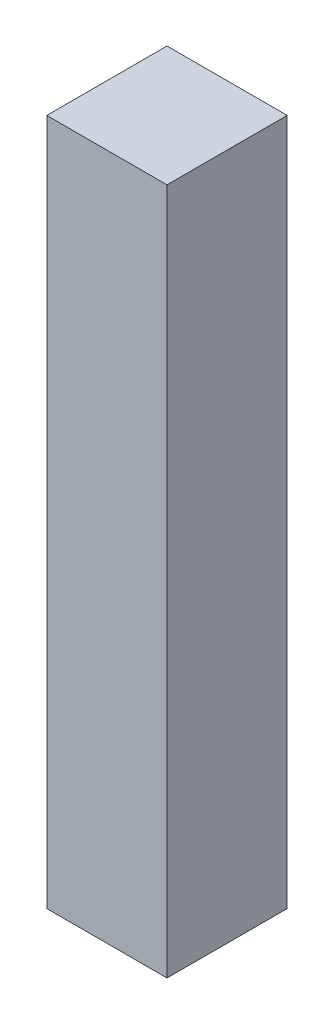
ISO-10303-21;
HEADER;
FILE_DESCRIPTION(('STEP AP214'),'2;1');
FILE_NAME('part.step','',(''),(''),'','','');
FILE_SCHEMA(('AUTOMOTIVE_DESIGN { 1 0 10303 214 1 1 1 1 }'));
ENDSEC;
DATA;
#1=APPLICATION_CONTEXT('core data for automotive mechanical design processes');
#2=APPLICATION_PROTOCOL_DEFINITION('international standard','automotive_design',2000,#1);
#3=PRODUCT_CONTEXT('',#1,'mechanical');
#4=PRODUCT('Part','Part','',(#3));
#5=PRODUCT_RELATED_PRODUCT_CATEGORY('part','',(#4));
#6=PRODUCT_DEFINITION_FORMATION('','',#4);
#7=PRODUCT_DEFINITION_CONTEXT('part definition',#1,'design');
#8=PRODUCT_DEFINITION('design','',#6,#7);
#9=PRODUCT_DEFINITION_SHAPE('','',#8);
#10=(LENGTH_UNIT() NAMED_UNIT(*) SI_UNIT(.MILLI.,.METRE.));
#11=(NAMED_UNIT(*) PLANE_ANGLE_UNIT() SI_UNIT($,.RADIAN.));
#12=(NAMED_UNIT(*) SI_UNIT($,.STERADIAN.) SOLID_ANGLE_UNIT());
#13=UNCERTAINTY_MEASURE_WITH_UNIT(LENGTH_MEASURE(1.E-05),#10,'distance_accuracy_value','');
#14=(GEOMETRIC_REPRESENTATION_CONTEXT(3) GLOBAL_UNCERTAINTY_ASSIGNED_CONTEXT((#13)) GLOBAL_UNIT_ASSIGNED_CONTEXT((#10,
#11,#12)) REPRESENTATION_CONTEXT('',''));
#15=CARTESIAN_POINT('',(0.,0.,0.));
#16=DIRECTION('',(0.,0.,1.));
#17=DIRECTION('',(1.,0.,0.));
#18=AXIS2_PLACEMENT_3D('',#15,#16,#17);
#19=CARTESIAN_POINT('',(-0.00999999999999891,200.,-35.01));
#20=DIRECTION('',(0.,1.,0.));
#21=DIRECTION('',(0.,0.,1.));
#22=AXIS2_PLACEMENT_3D('',#19,#20,#21);
#23=PLANE('',#22);
#24=DIRECTION('',(0.,0.,1.));
#25=VECTOR('',#24,1.);
#26=CARTESIAN_POINT('',(35.,200.,-17.5));
#27=LINE('',#26,#25);
#28=CARTESIAN_POINT('',(35.,200.,-35.));
#29=VERTEX_POINT('',#28);
#30=CARTESIAN_POINT('',(35.,200.,0.));
#31=VERTEX_POINT('',#30);
#32=EDGE_CURVE('E71',#29,#31,#27,.T.);
#33=ORIENTED_EDGE('',*,*,#32,.F.);
#34=DIRECTION('',(1.,0.,0.));
#35=VECTOR('',#34,1.);
#36=CARTESIAN_POINT('',(17.5,200.,-35.));
#37=LINE('',#36,#35);
#38=CARTESIAN_POINT('',(0.,200.,-35.));
#39=VERTEX_POINT('',#38);
#40=EDGE_CURVE('E56',#39,#29,#37,.T.);
#41=ORIENTED_EDGE('',*,*,#40,.F.);
#42=DIRECTION('',(0.,0.,-1.));
#43=VECTOR('',#42,1.);
#44=CARTESIAN_POINT('',(0.,200.,-17.5));
#45=LINE('',#44,#43);
#46=CARTESIAN_POINT('',(0.,200.,0.));
#47=VERTEX_POINT('',#46);
#48=EDGE_CURVE('E61',#47,#39,#45,.T.);
#49=ORIENTED_EDGE('',*,*,#48,.F.);
#50=DIRECTION('',(-1.,0.,0.));
#51=VECTOR('',#50,1.);
#52=CARTESIAN_POINT('',(17.5,200.,0.));
#53=LINE('',#52,#51);
#54=EDGE_CURVE('E99',#31,#47,#53,.T.);
#55=ORIENTED_EDGE('',*,*,#54,.F.);
#56=EDGE_LOOP('',(#33,#41,#49,#55));
#57=FACE_BOUND('',#56,.T.);
#58=ADVANCED_FACE('F17',(#57),#23,.T.);
#59=CARTESIAN_POINT('',(26.5966017177982,5.,-29.6166017177982));
#60=DIRECTION('',(0.,-1.,0.));
#61=DIRECTION('',(1.,0.,0.));
#62=AXIS2_PLACEMENT_3D('',#59,#60,#61);
#63=PLANE('',#62);
#64=CARTESIAN_POINT('',(28.1066017177982,5.,-28.1066017177982));
#65=DIRECTION('',(0.,1.,0.));
#66=DIRECTION('',(0.,0.,1.));
#67=AXIS2_PLACEMENT_3D('',#64,#65,#66);
#68=CIRCLE('',#67,1.5);
#69=CARTESIAN_POINT('',(28.1066017177982,5.,-26.6066017177982));
#70=VERTEX_POINT('',#69);
#71=EDGE_CURVE('E21',#70,#70,#68,.T.);
#72=ORIENTED_EDGE('',*,*,#71,.F.);
#73=EDGE_LOOP('',(#72));
#74=FACE_BOUND('',#73,.T.);
#75=ADVANCED_FACE('F181',(#74),#63,.T.);
#76=CARTESIAN_POINT('',(0.,-0.01,-35.01));
#77=DIRECTION('',(-1.,0.,0.));
#78=DIRECTION('',(0.,0.,1.));
#79=AXIS2_PLACEMENT_3D('',#76,#77,#78);
#80=PLANE('',#79);
#81=ORIENTED_EDGE('',*,*,#48,.T.);
#82=DIRECTION('',(0.,1.,0.));
#83=VECTOR('',#82,1.);
#84=CARTESIAN_POINT('',(0.,100.,-35.));
#85=LINE('',#84,#83);
#86=CARTESIAN_POINT('',(0.,0.,-35.));
#87=VERTEX_POINT('',#86);
#88=EDGE_CURVE('E63',#87,#39,#85,.T.);
#89=ORIENTED_EDGE('',*,*,#88,.F.);
#90=DIRECTION('',(0.,0.,-1.));
#91=VECTOR('',#90,1.);
#92=CARTESIAN_POINT('',(0.,0.,-17.5));
#93=LINE('',#92,#91);
#94=CARTESIAN_POINT('',(0.,0.,0.));
#95=VERTEX_POINT('',#94);
#96=EDGE_CURVE('E96',#95,#87,#93,.T.);
#97=ORIENTED_EDGE('',*,*,#96,.F.);
#98=DIRECTION('',(0.,-1.,0.));
#99=VECTOR('',#98,1.);
#100=CARTESIAN_POINT('',(0.,100.,0.));
#101=LINE('',#100,#99);
#102=EDGE_CURVE('E66',#47,#95,#101,.T.);
#103=ORIENTED_EDGE('',*,*,#102,.F.);
#104=EDGE_LOOP('',(#81,#89,#97,#103));
#105=FACE_BOUND('',#104,.T.);
#106=ADVANCED_FACE('F62',(#105),#80,.T.);
#107=CARTESIAN_POINT('',(35.01,-0.01,-35.));
#108=DIRECTION('',(0.,0.,-1.));
#109=DIRECTION('',(-1.,0.,0.));
#110=AXIS2_PLACEMENT_3D('',#107,#108,#109);
#111=PLANE('',#110);
#112=ORIENTED_EDGE('',*,*,#40,.T.);
#113=DIRECTION('',(0.,1.,0.));
#114=VECTOR('',#113,1.);
#115=CARTESIAN_POINT('',(35.,100.,-35.));
#116=LINE('',#115,#114);
#117=CARTESIAN_POINT('',(35.,0.,-35.));
#118=VERTEX_POINT('',#117);
#119=EDGE_CURVE('E73',#118,#29,#116,.T.);
#120=ORIENTED_EDGE('',*,*,#119,.F.);
#121=DIRECTION('',(1.,0.,0.));
#122=VECTOR('',#121,1.);
#123=CARTESIAN_POINT('',(17.5,0.,-35.));
#124=LINE('',#123,#122);
#125=EDGE_CURVE('E77',#87,#118,#124,.T.);
#126=ORIENTED_EDGE('',*,*,#125,.F.);
#127=ORIENTED_EDGE('',*,*,#88,.T.);
#128=EDGE_LOOP('',(#112,#120,#126,#127));
#129=FACE_BOUND('',#128,.T.);
#130=ADVANCED_FACE('F75',(#129),#111,.T.);
#131=CARTESIAN_POINT('',(35.,-0.01,0.01));
#132=DIRECTION('',(1.,0.,0.));
#133=DIRECTION('',(0.,0.,-1.));
#134=AXIS2_PLACEMENT_3D('',#131,#132,#133);
#135=PLANE('',#134);
#136=ORIENTED_EDGE('',*,*,#32,.T.);
#137=DIRECTION('',(0.,1.,0.));
#138=VECTOR('',#137,1.);
#139=CARTESIAN_POINT('',(35.,100.,0.));
#140=LINE('',#139,#138);
#141=CARTESIAN_POINT('',(35.,0.,0.));
#142=VERTEX_POINT('',#141);
#143=EDGE_CURVE('E36',#142,#31,#140,.T.);
#144=ORIENTED_EDGE('',*,*,#143,.F.);
#145=DIRECTION('',(0.,0.,1.));
#146=VECTOR('',#145,1.);
#147=CARTESIAN_POINT('',(35.,0.,-17.5));
#148=LINE('',#147,#146);
#149=EDGE_CURVE('E89',#118,#142,#148,.T.);
#150=ORIENTED_EDGE('',*,*,#149,.F.);
#151=ORIENTED_EDGE('',*,*,#119,.T.);
#152=EDGE_LOOP('',(#136,#144,#150,#151));
#153=FACE_BOUND('',#152,.T.);
#154=ADVANCED_FACE('F102',(#153),#135,.T.);
#155=CARTESIAN_POINT('',(-0.01,-0.01,0.));
#156=DIRECTION('',(0.,0.,1.));
#157=DIRECTION('',(1.,0.,0.));
#158=AXIS2_PLACEMENT_3D('',#155,#156,#157);
#159=PLANE('',#158);
#160=ORIENTED_EDGE('',*,*,#54,.T.);
#161=ORIENTED_EDGE('',*,*,#102,.T.);
#162=DIRECTION('',(-1.,0.,0.));
#163=VECTOR('',#162,1.);
#164=CARTESIAN_POINT('',(17.5,0.,0.));
#165=LINE('',#164,#163);
#166=EDGE_CURVE('E85',#142,#95,#165,.T.);
#167=ORIENTED_EDGE('',*,*,#166,.F.);
#168=ORIENTED_EDGE('',*,*,#143,.T.);
#169=EDGE_LOOP('',(#160,#161,#167,#168));
#170=FACE_BOUND('',#169,.T.);
#171=ADVANCED_FACE('F105',(#170),#159,.T.);
#172=CARTESIAN_POINT('',(28.1066017177982,0.,-28.1066017177982));
#173=DIRECTION('',(0.,1.,0.));
#174=DIRECTION('',(0.,0.,1.));
#175=AXIS2_PLACEMENT_3D('',#172,#173,#174);
#176=CYLINDRICAL_SURFACE('',#175,1.5);
#177=ORIENTED_EDGE('',*,*,#71,.T.);
#178=EDGE_LOOP('',(#177));
#179=FACE_BOUND('',#178,.T.);
#180=CARTESIAN_POINT('',(28.1066017177982,0.,-28.1066017177982));
#181=DIRECTION('',(0.,1.,0.));
#182=DIRECTION('',(0.,0.,1.));
#183=AXIS2_PLACEMENT_3D('',#180,#181,#182);
#184=CIRCLE('',#183,1.5);
#185=CARTESIAN_POINT('',(28.1066017177982,0.,-26.6066017177982));
#186=VERTEX_POINT('',#185);
#187=EDGE_CURVE('E83',#186,#186,#184,.T.);
#188=ORIENTED_EDGE('',*,*,#187,.F.);
#189=EDGE_LOOP('',(#188));
#190=FACE_BOUND('',#189,.T.);
#191=ADVANCED_FACE('F107',(#179,#190),#176,.F.);
#192=CARTESIAN_POINT('',(35.01,0.,0.00999999999999891));
#193=DIRECTION('',(0.,-1.,0.));
#194=DIRECTION('',(-1.,0.,0.));
#195=AXIS2_PLACEMENT_3D('',#192,#193,#194);
#196=PLANE('',#195);
#197=ORIENTED_EDGE('',*,*,#187,.T.);
#198=EDGE_LOOP('',(#197));
#199=FACE_BOUND('',#198,.T.);
#200=CARTESIAN_POINT('',(6.89339828220179,0.,-6.89339828220179));
#201=DIRECTION('',(0.,1.,0.));
#202=DIRECTION('',(0.,0.,1.));
#203=AXIS2_PLACEMENT_3D('',#200,#201,#202);
#204=CIRCLE('',#203,1.5);
#205=CARTESIAN_POINT('',(6.89339828220179,0.,-5.39339828220179));
#206=VERTEX_POINT('',#205);
#207=EDGE_CURVE('E27',#206,#206,#204,.F.);
#208=ORIENTED_EDGE('',*,*,#207,.F.);
#209=EDGE_LOOP('',(#208));
#210=FACE_BOUND('',#209,.T.);
#211=ORIENTED_EDGE('',*,*,#149,.T.);
#212=ORIENTED_EDGE('',*,*,#166,.T.);
#213=ORIENTED_EDGE('',*,*,#96,.T.);
#214=ORIENTED_EDGE('',*,*,#125,.T.);
#215=EDGE_LOOP('',(#211,#212,#213,#214));
#216=FACE_BOUND('',#215,.T.);
#217=ADVANCED_FACE('F103',(#199,#210,#216),#196,.T.);
#218=CARTESIAN_POINT('',(5.38339828220179,5.,-8.40339828220179));
#219=DIRECTION('',(0.,-1.,0.));
#220=DIRECTION('',(1.,0.,0.));
#221=AXIS2_PLACEMENT_3D('',#218,#219,#220);
#222=PLANE('',#221);
#223=CARTESIAN_POINT('',(6.89339828220179,5.,-6.89339828220179));
#224=DIRECTION('',(0.,1.,0.));
#225=DIRECTION('',(0.,0.,1.));
#226=AXIS2_PLACEMENT_3D('',#223,#224,#225);
#227=CIRCLE('',#226,1.5);
#228=CARTESIAN_POINT('',(6.89339828220179,5.,-5.39339828220179));
#229=VERTEX_POINT('',#228);
#230=EDGE_CURVE('E11',#229,#229,#227,.T.);
#231=ORIENTED_EDGE('',*,*,#230,.F.);
#232=EDGE_LOOP('',(#231));
#233=FACE_BOUND('',#232,.T.);
#234=ADVANCED_FACE('F118',(#233),#222,.T.);
#235=CARTESIAN_POINT('',(6.89339828220179,0.,-6.89339828220179));
#236=DIRECTION('',(0.,1.,0.));
#237=DIRECTION('',(0.,0.,1.));
#238=AXIS2_PLACEMENT_3D('',#235,#236,#237);
#239=CYLINDRICAL_SURFACE('',#238,1.5);
#240=ORIENTED_EDGE('',*,*,#230,.T.);
#241=EDGE_LOOP('',(#240));
#242=FACE_BOUND('',#241,.T.);
#243=ORIENTED_EDGE('',*,*,#207,.T.);
#244=EDGE_LOOP('',(#243));
#245=FACE_BOUND('',#244,.T.);
#246=ADVANCED_FACE('F19',(#242,#245),#239,.F.);
#247=CLOSED_SHELL('',(#58,#75,#106,#130,#154,#171,#191,#217,#234,#246));
#248=MANIFOLD_SOLID_BREP('B1',#247);
#249=ADVANCED_BREP_SHAPE_REPRESENTATION('',(#18,#248),#14);
#250=SHAPE_DEFINITION_REPRESENTATION(#9,#249);
ENDSEC;
END-ISO-10303-21;
